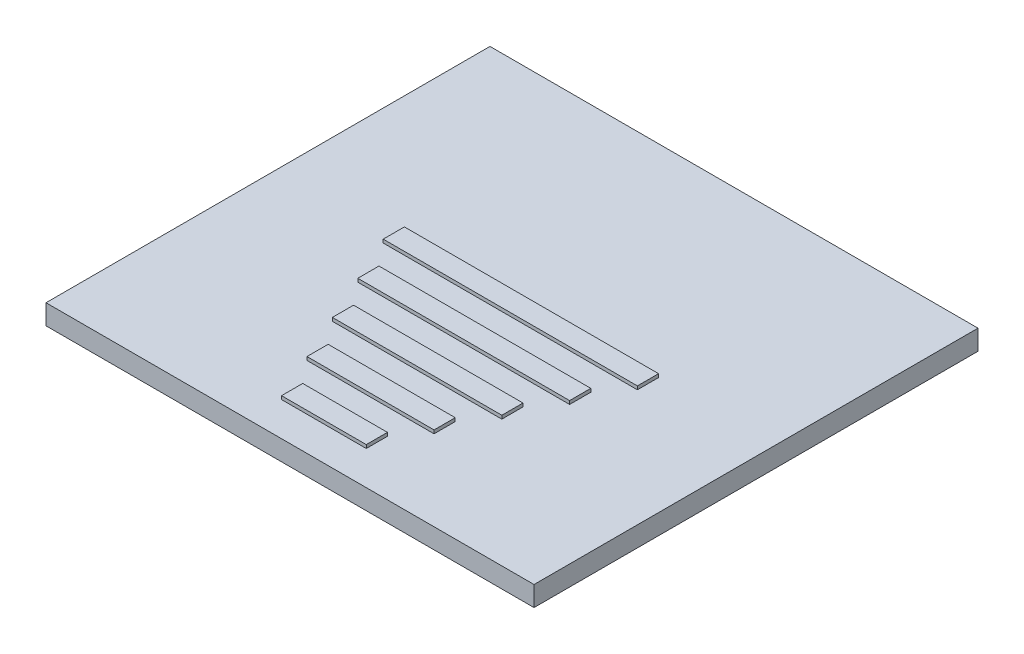
ISO-10303-21;
HEADER;
FILE_DESCRIPTION(('STEP AP214'),'2;1');
FILE_NAME('part.step','',(''),(''),'','','');
FILE_SCHEMA(('AUTOMOTIVE_DESIGN { 1 0 10303 214 1 1 1 1 }'));
ENDSEC;
DATA;
#1=APPLICATION_CONTEXT('core data for automotive mechanical design processes');
#2=APPLICATION_PROTOCOL_DEFINITION('international standard','automotive_design',2000,#1);
#3=PRODUCT_CONTEXT('',#1,'mechanical');
#4=PRODUCT('Part','Part','',(#3));
#5=PRODUCT_RELATED_PRODUCT_CATEGORY('part','',(#4));
#6=PRODUCT_DEFINITION_FORMATION('','',#4);
#7=PRODUCT_DEFINITION_CONTEXT('part definition',#1,'design');
#8=PRODUCT_DEFINITION('design','',#6,#7);
#9=PRODUCT_DEFINITION_SHAPE('','',#8);
#10=(LENGTH_UNIT() NAMED_UNIT(*) SI_UNIT(.MILLI.,.METRE.));
#11=(NAMED_UNIT(*) PLANE_ANGLE_UNIT() SI_UNIT($,.RADIAN.));
#12=(NAMED_UNIT(*) SI_UNIT($,.STERADIAN.) SOLID_ANGLE_UNIT());
#13=UNCERTAINTY_MEASURE_WITH_UNIT(LENGTH_MEASURE(1.E-05),#10,'distance_accuracy_value','');
#14=(GEOMETRIC_REPRESENTATION_CONTEXT(3) GLOBAL_UNCERTAINTY_ASSIGNED_CONTEXT((#13)) GLOBAL_UNIT_ASSIGNED_CONTEXT((#10,
#11,#12)) REPRESENTATION_CONTEXT('',''));
#15=CARTESIAN_POINT('',(0.,0.,0.));
#16=DIRECTION('',(0.,0.,1.));
#17=DIRECTION('',(1.,0.,0.));
#18=AXIS2_PLACEMENT_3D('',#15,#16,#17);
#19=CARTESIAN_POINT('',(0.,1.499997,0.));
#20=DIRECTION('',(0.,1.,0.));
#21=DIRECTION('',(0.,0.,1.));
#22=AXIS2_PLACEMENT_3D('',#19,#20,#21);
#23=PLANE('',#22);
#24=DIRECTION('',(0.,0.,1.));
#25=VECTOR('',#24,1.);
#26=CARTESIAN_POINT('',(-18.288,1.499997,16.637));
#27=LINE('',#26,#25);
#28=CARTESIAN_POINT('',(-18.288,1.499997,-16.637));
#29=VERTEX_POINT('',#28);
#30=CARTESIAN_POINT('',(-18.288,1.499997,16.637));
#31=VERTEX_POINT('',#30);
#32=EDGE_CURVE('E398',#29,#31,#27,.T.);
#33=ORIENTED_EDGE('',*,*,#32,.T.);
#34=DIRECTION('',(1.,0.,0.));
#35=VECTOR('',#34,1.);
#36=CARTESIAN_POINT('',(18.288,1.499997,16.637));
#37=LINE('',#36,#35);
#38=CARTESIAN_POINT('',(18.288,1.499997,16.637));
#39=VERTEX_POINT('',#38);
#40=EDGE_CURVE('E402',#31,#39,#37,.T.);
#41=ORIENTED_EDGE('',*,*,#40,.T.);
#42=DIRECTION('',(0.,0.,-1.));
#43=VECTOR('',#42,1.);
#44=CARTESIAN_POINT('',(18.288,1.499997,16.637));
#45=LINE('',#44,#43);
#46=CARTESIAN_POINT('',(18.288,1.499997,-16.637));
#47=VERTEX_POINT('',#46);
#48=EDGE_CURVE('E406',#39,#47,#45,.T.);
#49=ORIENTED_EDGE('',*,*,#48,.T.);
#50=DIRECTION('',(-1.,0.,0.));
#51=VECTOR('',#50,1.);
#52=CARTESIAN_POINT('',(18.288,1.499997,-16.637));
#53=LINE('',#52,#51);
#54=EDGE_CURVE('E409',#47,#29,#53,.T.);
#55=ORIENTED_EDGE('',*,*,#54,.T.);
#56=EDGE_LOOP('',(#33,#41,#49,#55));
#57=FACE_BOUND('',#56,.T.);
#58=DIRECTION('',(1.,0.,0.));
#59=VECTOR('',#58,1.);
#60=CARTESIAN_POINT('',(-9.525,1.499997,0.126999999999997));
#61=LINE('',#60,#59);
#62=CARTESIAN_POINT('',(-9.525,1.499997,0.126999999999997));
#63=VERTEX_POINT('',#62);
#64=CARTESIAN_POINT('',(9.525,1.499997,0.126999999999997));
#65=VERTEX_POINT('',#64);
#66=EDGE_CURVE('E375',#63,#65,#61,.T.);
#67=ORIENTED_EDGE('',*,*,#66,.F.);
#68=DIRECTION('',(0.,0.,1.));
#69=VECTOR('',#68,1.);
#70=CARTESIAN_POINT('',(-9.525,1.499997,-1.4605));
#71=LINE('',#70,#69);
#72=CARTESIAN_POINT('',(-9.525,1.499997,-1.4605));
#73=VERTEX_POINT('',#72);
#74=EDGE_CURVE('E356',#73,#63,#71,.T.);
#75=ORIENTED_EDGE('',*,*,#74,.F.);
#76=DIRECTION('',(-1.,0.,0.));
#77=VECTOR('',#76,1.);
#78=CARTESIAN_POINT('',(-9.525,1.499997,-1.4605));
#79=LINE('',#78,#77);
#80=CARTESIAN_POINT('',(9.525,1.499997,-1.4605));
#81=VERTEX_POINT('',#80);
#82=EDGE_CURVE('E362',#81,#73,#79,.T.);
#83=ORIENTED_EDGE('',*,*,#82,.F.);
#84=DIRECTION('',(0.,0.,-1.));
#85=VECTOR('',#84,1.);
#86=CARTESIAN_POINT('',(9.525,1.499997,-1.4605));
#87=LINE('',#86,#85);
#88=EDGE_CURVE('E378',#65,#81,#87,.T.);
#89=ORIENTED_EDGE('',*,*,#88,.F.);
#90=EDGE_LOOP('',(#67,#75,#83,#89));
#91=FACE_BOUND('',#90,.T.);
#92=DIRECTION('',(1.,0.,0.));
#93=VECTOR('',#92,1.);
#94=CARTESIAN_POINT('',(-6.35,1.499997,7.112));
#95=LINE('',#94,#93);
#96=CARTESIAN_POINT('',(-6.35,1.499997,7.112));
#97=VERTEX_POINT('',#96);
#98=CARTESIAN_POINT('',(6.35,1.499997,7.11199999999999));
#99=VERTEX_POINT('',#98);
#100=EDGE_CURVE('E334',#97,#99,#95,.T.);
#101=ORIENTED_EDGE('',*,*,#100,.F.);
#102=DIRECTION('',(0.,0.,1.));
#103=VECTOR('',#102,1.);
#104=CARTESIAN_POINT('',(-6.35,1.499997,5.5245));
#105=LINE('',#104,#103);
#106=CARTESIAN_POINT('',(-6.35,1.499997,5.5245));
#107=VERTEX_POINT('',#106);
#108=EDGE_CURVE('E315',#107,#97,#105,.T.);
#109=ORIENTED_EDGE('',*,*,#108,.F.);
#110=DIRECTION('',(-1.,0.,0.));
#111=VECTOR('',#110,1.);
#112=CARTESIAN_POINT('',(-6.35,1.499997,5.5245));
#113=LINE('',#112,#111);
#114=CARTESIAN_POINT('',(6.35,1.499997,5.52449999999999));
#115=VERTEX_POINT('',#114);
#116=EDGE_CURVE('E321',#115,#107,#113,.T.);
#117=ORIENTED_EDGE('',*,*,#116,.F.);
#118=DIRECTION('',(0.,0.,-1.));
#119=VECTOR('',#118,1.);
#120=CARTESIAN_POINT('',(6.35,1.499997,5.52449999999999));
#121=LINE('',#120,#119);
#122=EDGE_CURVE('E337',#99,#115,#121,.T.);
#123=ORIENTED_EDGE('',*,*,#122,.F.);
#124=EDGE_LOOP('',(#101,#109,#117,#123));
#125=FACE_BOUND('',#124,.T.);
#126=DIRECTION('',(1.,0.,0.));
#127=VECTOR('',#126,1.);
#128=CARTESIAN_POINT('',(-4.7625,1.499997,10.6045));
#129=LINE('',#128,#127);
#130=CARTESIAN_POINT('',(-4.7625,1.499997,10.6045));
#131=VERTEX_POINT('',#130);
#132=CARTESIAN_POINT('',(4.7625,1.499997,10.6045));
#133=VERTEX_POINT('',#132);
#134=EDGE_CURVE('E293',#131,#133,#129,.T.);
#135=ORIENTED_EDGE('',*,*,#134,.F.);
#136=DIRECTION('',(0.,0.,1.));
#137=VECTOR('',#136,1.);
#138=CARTESIAN_POINT('',(-4.7625,1.499997,9.017));
#139=LINE('',#138,#137);
#140=CARTESIAN_POINT('',(-4.7625,1.499997,9.017));
#141=VERTEX_POINT('',#140);
#142=EDGE_CURVE('E274',#141,#131,#139,.T.);
#143=ORIENTED_EDGE('',*,*,#142,.F.);
#144=DIRECTION('',(-1.,0.,0.));
#145=VECTOR('',#144,1.);
#146=CARTESIAN_POINT('',(-4.7625,1.499997,9.017));
#147=LINE('',#146,#145);
#148=CARTESIAN_POINT('',(4.7625,1.499997,9.017));
#149=VERTEX_POINT('',#148);
#150=EDGE_CURVE('E280',#149,#141,#147,.T.);
#151=ORIENTED_EDGE('',*,*,#150,.F.);
#152=DIRECTION('',(0.,0.,-1.));
#153=VECTOR('',#152,1.);
#154=CARTESIAN_POINT('',(4.7625,1.499997,9.017));
#155=LINE('',#154,#153);
#156=EDGE_CURVE('E296',#133,#149,#155,.T.);
#157=ORIENTED_EDGE('',*,*,#156,.F.);
#158=EDGE_LOOP('',(#135,#143,#151,#157));
#159=FACE_BOUND('',#158,.T.);
#160=DIRECTION('',(1.,0.,0.));
#161=VECTOR('',#160,1.);
#162=CARTESIAN_POINT('',(-3.175,1.499997,14.097));
#163=LINE('',#162,#161);
#164=CARTESIAN_POINT('',(-3.175,1.499997,14.097));
#165=VERTEX_POINT('',#164);
#166=CARTESIAN_POINT('',(3.175,1.499997,14.097));
#167=VERTEX_POINT('',#166);
#168=EDGE_CURVE('E235',#165,#167,#163,.T.);
#169=ORIENTED_EDGE('',*,*,#168,.F.);
#170=DIRECTION('',(0.,0.,1.));
#171=VECTOR('',#170,1.);
#172=CARTESIAN_POINT('',(-3.175,1.499997,12.5095));
#173=LINE('',#172,#171);
#174=CARTESIAN_POINT('',(-3.175,1.499997,12.5095));
#175=VERTEX_POINT('',#174);
#176=EDGE_CURVE('E230',#175,#165,#173,.T.);
#177=ORIENTED_EDGE('',*,*,#176,.F.);
#178=DIRECTION('',(-1.,0.,0.));
#179=VECTOR('',#178,1.);
#180=CARTESIAN_POINT('',(-3.175,1.499997,12.5095));
#181=LINE('',#180,#179);
#182=CARTESIAN_POINT('',(3.175,1.499997,12.5095));
#183=VERTEX_POINT('',#182);
#184=EDGE_CURVE('E245',#183,#175,#181,.T.);
#185=ORIENTED_EDGE('',*,*,#184,.F.);
#186=DIRECTION('',(0.,0.,-1.));
#187=VECTOR('',#186,1.);
#188=CARTESIAN_POINT('',(3.175,1.499997,12.5095));
#189=LINE('',#188,#187);
#190=EDGE_CURVE('E257',#167,#183,#189,.T.);
#191=ORIENTED_EDGE('',*,*,#190,.F.);
#192=EDGE_LOOP('',(#169,#177,#185,#191));
#193=FACE_BOUND('',#192,.T.);
#194=DIRECTION('',(1.,0.,0.));
#195=VECTOR('',#194,1.);
#196=CARTESIAN_POINT('',(-7.9375,1.499997,3.6195));
#197=LINE('',#196,#195);
#198=CARTESIAN_POINT('',(-7.9375,1.499997,3.6195));
#199=VERTEX_POINT('',#198);
#200=CARTESIAN_POINT('',(7.9375,1.499997,3.6195));
#201=VERTEX_POINT('',#200);
#202=EDGE_CURVE('E750',#199,#201,#197,.T.);
#203=ORIENTED_EDGE('',*,*,#202,.F.);
#204=DIRECTION('',(0.,0.,1.));
#205=VECTOR('',#204,1.);
#206=CARTESIAN_POINT('',(-7.9375,1.499997,2.032));
#207=LINE('',#206,#205);
#208=CARTESIAN_POINT('',(-7.9375,1.499997,2.032));
#209=VERTEX_POINT('',#208);
#210=EDGE_CURVE('E227',#209,#199,#207,.T.);
#211=ORIENTED_EDGE('',*,*,#210,.F.);
#212=DIRECTION('',(-1.,0.,0.));
#213=VECTOR('',#212,1.);
#214=CARTESIAN_POINT('',(-7.9375,1.499997,2.032));
#215=LINE('',#214,#213);
#216=CARTESIAN_POINT('',(7.9375,1.499997,2.032));
#217=VERTEX_POINT('',#216);
#218=EDGE_CURVE('E223',#217,#209,#215,.T.);
#219=ORIENTED_EDGE('',*,*,#218,.F.);
#220=DIRECTION('',(0.,0.,-1.));
#221=VECTOR('',#220,1.);
#222=CARTESIAN_POINT('',(7.9375,1.499997,2.032));
#223=LINE('',#222,#221);
#224=EDGE_CURVE('E746',#201,#217,#223,.T.);
#225=ORIENTED_EDGE('',*,*,#224,.F.);
#226=EDGE_LOOP('',(#203,#211,#219,#225));
#227=FACE_BOUND('',#226,.T.);
#228=ADVANCED_FACE('F39',(#57,#91,#125,#159,#193,#227),#23,.T.);
#229=CARTESIAN_POINT('',(-18.288,1.499997,16.637));
#230=DIRECTION('',(1.,0.,0.));
#231=DIRECTION('',(0.,0.,-1.));
#232=AXIS2_PLACEMENT_3D('',#229,#230,#231);
#233=PLANE('',#232);
#234=DIRECTION('',(0.,0.,1.));
#235=VECTOR('',#234,1.);
#236=CARTESIAN_POINT('',(-18.288,0.,16.637));
#237=LINE('',#236,#235);
#238=CARTESIAN_POINT('',(-18.288,0.,-16.637));
#239=VERTEX_POINT('',#238);
#240=CARTESIAN_POINT('',(-18.288,0.,16.637));
#241=VERTEX_POINT('',#240);
#242=EDGE_CURVE('E397',#239,#241,#237,.T.);
#243=ORIENTED_EDGE('',*,*,#242,.T.);
#244=DIRECTION('',(0.,-1.,0.));
#245=VECTOR('',#244,1.);
#246=CARTESIAN_POINT('',(-18.288,1.499997,16.637));
#247=LINE('',#246,#245);
#248=EDGE_CURVE('E11',#31,#241,#247,.T.);
#249=ORIENTED_EDGE('',*,*,#248,.F.);
#250=ORIENTED_EDGE('',*,*,#32,.F.);
#251=DIRECTION('',(0.,-1.,0.));
#252=VECTOR('',#251,1.);
#253=CARTESIAN_POINT('',(-18.288,1.499997,-16.637));
#254=LINE('',#253,#252);
#255=EDGE_CURVE('E412',#29,#239,#254,.T.);
#256=ORIENTED_EDGE('',*,*,#255,.T.);
#257=EDGE_LOOP('',(#243,#249,#250,#256));
#258=FACE_BOUND('',#257,.T.);
#259=ADVANCED_FACE('F41',(#258),#233,.F.);
#260=CARTESIAN_POINT('',(18.288,1.499997,16.637));
#261=DIRECTION('',(0.,0.,-1.));
#262=DIRECTION('',(-1.,0.,0.));
#263=AXIS2_PLACEMENT_3D('',#260,#261,#262);
#264=PLANE('',#263);
#265=DIRECTION('',(1.,0.,0.));
#266=VECTOR('',#265,1.);
#267=CARTESIAN_POINT('',(18.288,0.,16.637));
#268=LINE('',#267,#266);
#269=CARTESIAN_POINT('',(18.288,0.,16.637));
#270=VERTEX_POINT('',#269);
#271=EDGE_CURVE('E416',#241,#270,#268,.T.);
#272=ORIENTED_EDGE('',*,*,#271,.T.);
#273=DIRECTION('',(0.,-1.,0.));
#274=VECTOR('',#273,1.);
#275=CARTESIAN_POINT('',(18.288,1.499997,16.637));
#276=LINE('',#275,#274);
#277=EDGE_CURVE('E48',#39,#270,#276,.T.);
#278=ORIENTED_EDGE('',*,*,#277,.F.);
#279=ORIENTED_EDGE('',*,*,#40,.F.);
#280=ORIENTED_EDGE('',*,*,#248,.T.);
#281=EDGE_LOOP('',(#272,#278,#279,#280));
#282=FACE_BOUND('',#281,.T.);
#283=ADVANCED_FACE('F452',(#282),#264,.F.);
#284=CARTESIAN_POINT('',(18.288,1.499997,16.637));
#285=DIRECTION('',(-1.,0.,0.));
#286=DIRECTION('',(0.,0.,1.));
#287=AXIS2_PLACEMENT_3D('',#284,#285,#286);
#288=PLANE('',#287);
#289=DIRECTION('',(0.,0.,-1.));
#290=VECTOR('',#289,1.);
#291=CARTESIAN_POINT('',(18.288,0.,16.637));
#292=LINE('',#291,#290);
#293=CARTESIAN_POINT('',(18.288,0.,-16.637));
#294=VERTEX_POINT('',#293);
#295=EDGE_CURVE('E419',#270,#294,#292,.T.);
#296=ORIENTED_EDGE('',*,*,#295,.T.);
#297=DIRECTION('',(0.,-1.,0.));
#298=VECTOR('',#297,1.);
#299=CARTESIAN_POINT('',(18.288,1.499997,-16.637));
#300=LINE('',#299,#298);
#301=EDGE_CURVE('E427',#47,#294,#300,.T.);
#302=ORIENTED_EDGE('',*,*,#301,.F.);
#303=ORIENTED_EDGE('',*,*,#48,.F.);
#304=ORIENTED_EDGE('',*,*,#277,.T.);
#305=EDGE_LOOP('',(#296,#302,#303,#304));
#306=FACE_BOUND('',#305,.T.);
#307=ADVANCED_FACE('F436',(#306),#288,.F.);
#308=CARTESIAN_POINT('',(18.288,1.499997,-16.637));
#309=DIRECTION('',(0.,0.,1.));
#310=DIRECTION('',(1.,0.,0.));
#311=AXIS2_PLACEMENT_3D('',#308,#309,#310);
#312=PLANE('',#311);
#313=DIRECTION('',(-1.,0.,0.));
#314=VECTOR('',#313,1.);
#315=CARTESIAN_POINT('',(18.288,0.,-16.637));
#316=LINE('',#315,#314);
#317=EDGE_CURVE('E403',#294,#239,#316,.T.);
#318=ORIENTED_EDGE('',*,*,#317,.T.);
#319=ORIENTED_EDGE('',*,*,#255,.F.);
#320=ORIENTED_EDGE('',*,*,#54,.F.);
#321=ORIENTED_EDGE('',*,*,#301,.T.);
#322=EDGE_LOOP('',(#318,#319,#320,#321));
#323=FACE_BOUND('',#322,.T.);
#324=ADVANCED_FACE('F445',(#323),#312,.F.);
#325=CARTESIAN_POINT('',(0.,0.,0.));
#326=DIRECTION('',(0.,1.,0.));
#327=DIRECTION('',(0.,0.,1.));
#328=AXIS2_PLACEMENT_3D('',#325,#326,#327);
#329=PLANE('',#328);
#330=ORIENTED_EDGE('',*,*,#242,.F.);
#331=ORIENTED_EDGE('',*,*,#317,.F.);
#332=ORIENTED_EDGE('',*,*,#295,.F.);
#333=ORIENTED_EDGE('',*,*,#271,.F.);
#334=EDGE_LOOP('',(#330,#331,#332,#333));
#335=FACE_BOUND('',#334,.T.);
#336=ADVANCED_FACE('F442',(#335),#329,.F.);
#337=CARTESIAN_POINT('',(-9.525,1.753997,-1.4605));
#338=DIRECTION('',(1.,0.,0.));
#339=DIRECTION('',(0.,0.,-1.));
#340=AXIS2_PLACEMENT_3D('',#337,#338,#339);
#341=PLANE('',#340);
#342=ORIENTED_EDGE('',*,*,#74,.T.);
#343=DIRECTION('',(0.,-1.,0.));
#344=VECTOR('',#343,1.);
#345=CARTESIAN_POINT('',(-9.525,1.753997,0.126999999999997));
#346=LINE('',#345,#344);
#347=CARTESIAN_POINT('',(-9.525,1.753997,0.126999999999997));
#348=VERTEX_POINT('',#347);
#349=EDGE_CURVE('E394',#348,#63,#346,.T.);
#350=ORIENTED_EDGE('',*,*,#349,.F.);
#351=DIRECTION('',(0.,0.,1.));
#352=VECTOR('',#351,1.);
#353=CARTESIAN_POINT('',(-9.525,1.753997,-1.4605));
#354=LINE('',#353,#352);
#355=CARTESIAN_POINT('',(-9.525,1.753997,-1.4605));
#356=VERTEX_POINT('',#355);
#357=EDGE_CURVE('E357',#356,#348,#354,.T.);
#358=ORIENTED_EDGE('',*,*,#357,.F.);
#359=DIRECTION('',(0.,-1.,0.));
#360=VECTOR('',#359,1.);
#361=CARTESIAN_POINT('',(-9.525,1.753997,-1.4605));
#362=LINE('',#361,#360);
#363=EDGE_CURVE('E371',#356,#73,#362,.T.);
#364=ORIENTED_EDGE('',*,*,#363,.T.);
#365=EDGE_LOOP('',(#342,#350,#358,#364));
#366=FACE_BOUND('',#365,.T.);
#367=ADVANCED_FACE('F465',(#366),#341,.F.);
#368=CARTESIAN_POINT('',(-9.525,1.753997,0.126999999999997));
#369=DIRECTION('',(0.,0.,-1.));
#370=DIRECTION('',(-1.,0.,0.));
#371=AXIS2_PLACEMENT_3D('',#368,#369,#370);
#372=PLANE('',#371);
#373=ORIENTED_EDGE('',*,*,#66,.T.);
#374=DIRECTION('',(0.,-1.,0.));
#375=VECTOR('',#374,1.);
#376=CARTESIAN_POINT('',(9.525,1.753997,0.126999999999997));
#377=LINE('',#376,#375);
#378=CARTESIAN_POINT('',(9.525,1.753997,0.126999999999997));
#379=VERTEX_POINT('',#378);
#380=EDGE_CURVE('E390',#379,#65,#377,.T.);
#381=ORIENTED_EDGE('',*,*,#380,.F.);
#382=DIRECTION('',(1.,0.,0.));
#383=VECTOR('',#382,1.);
#384=CARTESIAN_POINT('',(-9.525,1.753997,0.126999999999997));
#385=LINE('',#384,#383);
#386=EDGE_CURVE('E361',#348,#379,#385,.T.);
#387=ORIENTED_EDGE('',*,*,#386,.F.);
#388=ORIENTED_EDGE('',*,*,#349,.T.);
#389=EDGE_LOOP('',(#373,#381,#387,#388));
#390=FACE_BOUND('',#389,.T.);
#391=ADVANCED_FACE('F484',(#390),#372,.F.);
#392=CARTESIAN_POINT('',(9.525,1.753997,-1.4605));
#393=DIRECTION('',(-1.,0.,0.));
#394=DIRECTION('',(0.,0.,1.));
#395=AXIS2_PLACEMENT_3D('',#392,#393,#394);
#396=PLANE('',#395);
#397=ORIENTED_EDGE('',*,*,#88,.T.);
#398=DIRECTION('',(0.,-1.,0.));
#399=VECTOR('',#398,1.);
#400=CARTESIAN_POINT('',(9.525,1.753997,-1.4605));
#401=LINE('',#400,#399);
#402=CARTESIAN_POINT('',(9.525,1.753997,-1.4605));
#403=VERTEX_POINT('',#402);
#404=EDGE_CURVE('E387',#403,#81,#401,.T.);
#405=ORIENTED_EDGE('',*,*,#404,.F.);
#406=DIRECTION('',(0.,0.,-1.));
#407=VECTOR('',#406,1.);
#408=CARTESIAN_POINT('',(9.525,1.753997,-1.4605));
#409=LINE('',#408,#407);
#410=EDGE_CURVE('E365',#379,#403,#409,.T.);
#411=ORIENTED_EDGE('',*,*,#410,.F.);
#412=ORIENTED_EDGE('',*,*,#380,.T.);
#413=EDGE_LOOP('',(#397,#405,#411,#412));
#414=FACE_BOUND('',#413,.T.);
#415=ADVANCED_FACE('F491',(#414),#396,.F.);
#416=CARTESIAN_POINT('',(-9.525,1.753997,-1.4605));
#417=DIRECTION('',(0.,0.,1.));
#418=DIRECTION('',(1.,0.,0.));
#419=AXIS2_PLACEMENT_3D('',#416,#417,#418);
#420=PLANE('',#419);
#421=ORIENTED_EDGE('',*,*,#82,.T.);
#422=ORIENTED_EDGE('',*,*,#363,.F.);
#423=DIRECTION('',(-1.,0.,0.));
#424=VECTOR('',#423,1.);
#425=CARTESIAN_POINT('',(-9.525,1.753997,-1.4605));
#426=LINE('',#425,#424);
#427=EDGE_CURVE('E368',#403,#356,#426,.T.);
#428=ORIENTED_EDGE('',*,*,#427,.F.);
#429=ORIENTED_EDGE('',*,*,#404,.T.);
#430=EDGE_LOOP('',(#421,#422,#428,#429));
#431=FACE_BOUND('',#430,.T.);
#432=ADVANCED_FACE('F498',(#431),#420,.F.);
#433=CARTESIAN_POINT('',(0.,1.753997,0.));
#434=DIRECTION('',(0.,1.,0.));
#435=DIRECTION('',(0.,0.,1.));
#436=AXIS2_PLACEMENT_3D('',#433,#434,#435);
#437=PLANE('',#436);
#438=ORIENTED_EDGE('',*,*,#357,.T.);
#439=ORIENTED_EDGE('',*,*,#386,.T.);
#440=ORIENTED_EDGE('',*,*,#410,.T.);
#441=ORIENTED_EDGE('',*,*,#427,.T.);
#442=EDGE_LOOP('',(#438,#439,#440,#441));
#443=FACE_BOUND('',#442,.T.);
#444=ADVANCED_FACE('F506',(#443),#437,.T.);
#445=CARTESIAN_POINT('',(-6.35,1.753997,5.5245));
#446=DIRECTION('',(1.,0.,0.));
#447=DIRECTION('',(0.,0.,-1.));
#448=AXIS2_PLACEMENT_3D('',#445,#446,#447);
#449=PLANE('',#448);
#450=ORIENTED_EDGE('',*,*,#108,.T.);
#451=DIRECTION('',(0.,-1.,0.));
#452=VECTOR('',#451,1.);
#453=CARTESIAN_POINT('',(-6.35,1.753997,7.112));
#454=LINE('',#453,#452);
#455=CARTESIAN_POINT('',(-6.35,1.753997,7.112));
#456=VERTEX_POINT('',#455);
#457=EDGE_CURVE('E353',#456,#97,#454,.T.);
#458=ORIENTED_EDGE('',*,*,#457,.F.);
#459=DIRECTION('',(0.,0.,1.));
#460=VECTOR('',#459,1.);
#461=CARTESIAN_POINT('',(-6.35,1.753997,5.5245));
#462=LINE('',#461,#460);
#463=CARTESIAN_POINT('',(-6.35,1.753997,5.5245));
#464=VERTEX_POINT('',#463);
#465=EDGE_CURVE('E316',#464,#456,#462,.T.);
#466=ORIENTED_EDGE('',*,*,#465,.F.);
#467=DIRECTION('',(0.,-1.,0.));
#468=VECTOR('',#467,1.);
#469=CARTESIAN_POINT('',(-6.35,1.753997,5.5245));
#470=LINE('',#469,#468);
#471=EDGE_CURVE('E330',#464,#107,#470,.T.);
#472=ORIENTED_EDGE('',*,*,#471,.T.);
#473=EDGE_LOOP('',(#450,#458,#466,#472));
#474=FACE_BOUND('',#473,.T.);
#475=ADVANCED_FACE('F514',(#474),#449,.F.);
#476=CARTESIAN_POINT('',(-6.35,1.753997,7.112));
#477=DIRECTION('',(0.,0.,-1.));
#478=DIRECTION('',(-1.,0.,0.));
#479=AXIS2_PLACEMENT_3D('',#476,#477,#478);
#480=PLANE('',#479);
#481=ORIENTED_EDGE('',*,*,#100,.T.);
#482=DIRECTION('',(0.,-1.,0.));
#483=VECTOR('',#482,1.);
#484=CARTESIAN_POINT('',(6.35,1.753997,7.11199999999999));
#485=LINE('',#484,#483);
#486=CARTESIAN_POINT('',(6.35,1.753997,7.11199999999999));
#487=VERTEX_POINT('',#486);
#488=EDGE_CURVE('E349',#487,#99,#485,.T.);
#489=ORIENTED_EDGE('',*,*,#488,.F.);
#490=DIRECTION('',(1.,0.,0.));
#491=VECTOR('',#490,1.);
#492=CARTESIAN_POINT('',(-6.35,1.753997,7.112));
#493=LINE('',#492,#491);
#494=EDGE_CURVE('E320',#456,#487,#493,.T.);
#495=ORIENTED_EDGE('',*,*,#494,.F.);
#496=ORIENTED_EDGE('',*,*,#457,.T.);
#497=EDGE_LOOP('',(#481,#489,#495,#496));
#498=FACE_BOUND('',#497,.T.);
#499=ADVANCED_FACE('F522',(#498),#480,.F.);
#500=CARTESIAN_POINT('',(6.35,1.753997,5.52449999999999));
#501=DIRECTION('',(-1.,0.,0.));
#502=DIRECTION('',(0.,0.,1.));
#503=AXIS2_PLACEMENT_3D('',#500,#501,#502);
#504=PLANE('',#503);
#505=ORIENTED_EDGE('',*,*,#122,.T.);
#506=DIRECTION('',(0.,-1.,0.));
#507=VECTOR('',#506,1.);
#508=CARTESIAN_POINT('',(6.35,1.753997,5.52449999999999));
#509=LINE('',#508,#507);
#510=CARTESIAN_POINT('',(6.35,1.753997,5.52449999999999));
#511=VERTEX_POINT('',#510);
#512=EDGE_CURVE('E346',#511,#115,#509,.T.);
#513=ORIENTED_EDGE('',*,*,#512,.F.);
#514=DIRECTION('',(0.,0.,-1.));
#515=VECTOR('',#514,1.);
#516=CARTESIAN_POINT('',(6.35,1.753997,5.52449999999999));
#517=LINE('',#516,#515);
#518=EDGE_CURVE('E324',#487,#511,#517,.T.);
#519=ORIENTED_EDGE('',*,*,#518,.F.);
#520=ORIENTED_EDGE('',*,*,#488,.T.);
#521=EDGE_LOOP('',(#505,#513,#519,#520));
#522=FACE_BOUND('',#521,.T.);
#523=ADVANCED_FACE('F530',(#522),#504,.F.);
#524=CARTESIAN_POINT('',(-6.35,1.753997,5.5245));
#525=DIRECTION('',(0.,0.,1.));
#526=DIRECTION('',(1.,0.,0.));
#527=AXIS2_PLACEMENT_3D('',#524,#525,#526);
#528=PLANE('',#527);
#529=ORIENTED_EDGE('',*,*,#116,.T.);
#530=ORIENTED_EDGE('',*,*,#471,.F.);
#531=DIRECTION('',(-1.,0.,0.));
#532=VECTOR('',#531,1.);
#533=CARTESIAN_POINT('',(-6.35,1.753997,5.5245));
#534=LINE('',#533,#532);
#535=EDGE_CURVE('E327',#511,#464,#534,.T.);
#536=ORIENTED_EDGE('',*,*,#535,.F.);
#537=ORIENTED_EDGE('',*,*,#512,.T.);
#538=EDGE_LOOP('',(#529,#530,#536,#537));
#539=FACE_BOUND('',#538,.T.);
#540=ADVANCED_FACE('F538',(#539),#528,.F.);
#541=CARTESIAN_POINT('',(0.,1.753997,0.));
#542=DIRECTION('',(0.,1.,0.));
#543=DIRECTION('',(0.,0.,1.));
#544=AXIS2_PLACEMENT_3D('',#541,#542,#543);
#545=PLANE('',#544);
#546=ORIENTED_EDGE('',*,*,#465,.T.);
#547=ORIENTED_EDGE('',*,*,#494,.T.);
#548=ORIENTED_EDGE('',*,*,#518,.T.);
#549=ORIENTED_EDGE('',*,*,#535,.T.);
#550=EDGE_LOOP('',(#546,#547,#548,#549));
#551=FACE_BOUND('',#550,.T.);
#552=ADVANCED_FACE('F546',(#551),#545,.T.);
#553=CARTESIAN_POINT('',(-4.7625,1.753997,9.017));
#554=DIRECTION('',(1.,0.,0.));
#555=DIRECTION('',(0.,0.,-1.));
#556=AXIS2_PLACEMENT_3D('',#553,#554,#555);
#557=PLANE('',#556);
#558=ORIENTED_EDGE('',*,*,#142,.T.);
#559=DIRECTION('',(0.,-1.,0.));
#560=VECTOR('',#559,1.);
#561=CARTESIAN_POINT('',(-4.7625,1.753997,10.6045));
#562=LINE('',#561,#560);
#563=CARTESIAN_POINT('',(-4.7625,1.753997,10.6045));
#564=VERTEX_POINT('',#563);
#565=EDGE_CURVE('E312',#564,#131,#562,.T.);
#566=ORIENTED_EDGE('',*,*,#565,.F.);
#567=DIRECTION('',(0.,0.,1.));
#568=VECTOR('',#567,1.);
#569=CARTESIAN_POINT('',(-4.7625,1.753997,9.017));
#570=LINE('',#569,#568);
#571=CARTESIAN_POINT('',(-4.7625,1.753997,9.017));
#572=VERTEX_POINT('',#571);
#573=EDGE_CURVE('E275',#572,#564,#570,.T.);
#574=ORIENTED_EDGE('',*,*,#573,.F.);
#575=DIRECTION('',(0.,-1.,0.));
#576=VECTOR('',#575,1.);
#577=CARTESIAN_POINT('',(-4.7625,1.753997,9.017));
#578=LINE('',#577,#576);
#579=EDGE_CURVE('E289',#572,#141,#578,.T.);
#580=ORIENTED_EDGE('',*,*,#579,.T.);
#581=EDGE_LOOP('',(#558,#566,#574,#580));
#582=FACE_BOUND('',#581,.T.);
#583=ADVANCED_FACE('F554',(#582),#557,.F.);
#584=CARTESIAN_POINT('',(-4.7625,1.753997,10.6045));
#585=DIRECTION('',(0.,0.,-1.));
#586=DIRECTION('',(-1.,0.,0.));
#587=AXIS2_PLACEMENT_3D('',#584,#585,#586);
#588=PLANE('',#587);
#589=ORIENTED_EDGE('',*,*,#134,.T.);
#590=DIRECTION('',(0.,-1.,0.));
#591=VECTOR('',#590,1.);
#592=CARTESIAN_POINT('',(4.7625,1.753997,10.6045));
#593=LINE('',#592,#591);
#594=CARTESIAN_POINT('',(4.7625,1.753997,10.6045));
#595=VERTEX_POINT('',#594);
#596=EDGE_CURVE('E308',#595,#133,#593,.T.);
#597=ORIENTED_EDGE('',*,*,#596,.F.);
#598=DIRECTION('',(1.,0.,0.));
#599=VECTOR('',#598,1.);
#600=CARTESIAN_POINT('',(-4.7625,1.753997,10.6045));
#601=LINE('',#600,#599);
#602=EDGE_CURVE('E279',#564,#595,#601,.T.);
#603=ORIENTED_EDGE('',*,*,#602,.F.);
#604=ORIENTED_EDGE('',*,*,#565,.T.);
#605=EDGE_LOOP('',(#589,#597,#603,#604));
#606=FACE_BOUND('',#605,.T.);
#607=ADVANCED_FACE('F562',(#606),#588,.F.);
#608=CARTESIAN_POINT('',(4.7625,1.753997,9.017));
#609=DIRECTION('',(-1.,0.,0.));
#610=DIRECTION('',(0.,0.,1.));
#611=AXIS2_PLACEMENT_3D('',#608,#609,#610);
#612=PLANE('',#611);
#613=ORIENTED_EDGE('',*,*,#156,.T.);
#614=DIRECTION('',(0.,-1.,0.));
#615=VECTOR('',#614,1.);
#616=CARTESIAN_POINT('',(4.7625,1.753997,9.017));
#617=LINE('',#616,#615);
#618=CARTESIAN_POINT('',(4.7625,1.753997,9.017));
#619=VERTEX_POINT('',#618);
#620=EDGE_CURVE('E305',#619,#149,#617,.T.);
#621=ORIENTED_EDGE('',*,*,#620,.F.);
#622=DIRECTION('',(0.,0.,-1.));
#623=VECTOR('',#622,1.);
#624=CARTESIAN_POINT('',(4.7625,1.753997,9.017));
#625=LINE('',#624,#623);
#626=EDGE_CURVE('E283',#595,#619,#625,.T.);
#627=ORIENTED_EDGE('',*,*,#626,.F.);
#628=ORIENTED_EDGE('',*,*,#596,.T.);
#629=EDGE_LOOP('',(#613,#621,#627,#628));
#630=FACE_BOUND('',#629,.T.);
#631=ADVANCED_FACE('F570',(#630),#612,.F.);
#632=CARTESIAN_POINT('',(-4.7625,1.753997,9.017));
#633=DIRECTION('',(0.,0.,1.));
#634=DIRECTION('',(1.,0.,0.));
#635=AXIS2_PLACEMENT_3D('',#632,#633,#634);
#636=PLANE('',#635);
#637=ORIENTED_EDGE('',*,*,#150,.T.);
#638=ORIENTED_EDGE('',*,*,#579,.F.);
#639=DIRECTION('',(-1.,0.,0.));
#640=VECTOR('',#639,1.);
#641=CARTESIAN_POINT('',(-4.7625,1.753997,9.017));
#642=LINE('',#641,#640);
#643=EDGE_CURVE('E286',#619,#572,#642,.T.);
#644=ORIENTED_EDGE('',*,*,#643,.F.);
#645=ORIENTED_EDGE('',*,*,#620,.T.);
#646=EDGE_LOOP('',(#637,#638,#644,#645));
#647=FACE_BOUND('',#646,.T.);
#648=ADVANCED_FACE('F578',(#647),#636,.F.);
#649=CARTESIAN_POINT('',(0.,1.753997,0.));
#650=DIRECTION('',(0.,1.,0.));
#651=DIRECTION('',(0.,0.,1.));
#652=AXIS2_PLACEMENT_3D('',#649,#650,#651);
#653=PLANE('',#652);
#654=ORIENTED_EDGE('',*,*,#573,.T.);
#655=ORIENTED_EDGE('',*,*,#602,.T.);
#656=ORIENTED_EDGE('',*,*,#626,.T.);
#657=ORIENTED_EDGE('',*,*,#643,.T.);
#658=EDGE_LOOP('',(#654,#655,#656,#657));
#659=FACE_BOUND('',#658,.T.);
#660=ADVANCED_FACE('F586',(#659),#653,.T.);
#661=CARTESIAN_POINT('',(-3.175,1.753997,12.5095));
#662=DIRECTION('',(1.,0.,0.));
#663=DIRECTION('',(0.,0.,-1.));
#664=AXIS2_PLACEMENT_3D('',#661,#662,#663);
#665=PLANE('',#664);
#666=ORIENTED_EDGE('',*,*,#176,.T.);
#667=DIRECTION('',(0.,-1.,0.));
#668=VECTOR('',#667,1.);
#669=CARTESIAN_POINT('',(-3.175,1.753997,14.097));
#670=LINE('',#669,#668);
#671=CARTESIAN_POINT('',(-3.175,1.753997,14.097));
#672=VERTEX_POINT('',#671);
#673=EDGE_CURVE('E271',#672,#165,#670,.T.);
#674=ORIENTED_EDGE('',*,*,#673,.F.);
#675=DIRECTION('',(0.,0.,1.));
#676=VECTOR('',#675,1.);
#677=CARTESIAN_POINT('',(-3.175,1.753997,12.5095));
#678=LINE('',#677,#676);
#679=CARTESIAN_POINT('',(-3.175,1.753997,12.5095));
#680=VERTEX_POINT('',#679);
#681=EDGE_CURVE('E240',#680,#672,#678,.T.);
#682=ORIENTED_EDGE('',*,*,#681,.F.);
#683=DIRECTION('',(0.,-1.,0.));
#684=VECTOR('',#683,1.);
#685=CARTESIAN_POINT('',(-3.175,1.753997,12.5095));
#686=LINE('',#685,#684);
#687=EDGE_CURVE('E253',#680,#175,#686,.T.);
#688=ORIENTED_EDGE('',*,*,#687,.T.);
#689=EDGE_LOOP('',(#666,#674,#682,#688));
#690=FACE_BOUND('',#689,.T.);
#691=ADVANCED_FACE('F594',(#690),#665,.F.);
#692=CARTESIAN_POINT('',(-3.175,1.753997,14.097));
#693=DIRECTION('',(0.,0.,-1.));
#694=DIRECTION('',(-1.,0.,0.));
#695=AXIS2_PLACEMENT_3D('',#692,#693,#694);
#696=PLANE('',#695);
#697=ORIENTED_EDGE('',*,*,#168,.T.);
#698=DIRECTION('',(0.,-1.,0.));
#699=VECTOR('',#698,1.);
#700=CARTESIAN_POINT('',(3.175,1.753997,14.097));
#701=LINE('',#700,#699);
#702=CARTESIAN_POINT('',(3.175,1.753997,14.097));
#703=VERTEX_POINT('',#702);
#704=EDGE_CURVE('E267',#703,#167,#701,.T.);
#705=ORIENTED_EDGE('',*,*,#704,.F.);
#706=DIRECTION('',(1.,0.,0.));
#707=VECTOR('',#706,1.);
#708=CARTESIAN_POINT('',(-3.175,1.753997,14.097));
#709=LINE('',#708,#707);
#710=EDGE_CURVE('E244',#672,#703,#709,.T.);
#711=ORIENTED_EDGE('',*,*,#710,.F.);
#712=ORIENTED_EDGE('',*,*,#673,.T.);
#713=EDGE_LOOP('',(#697,#705,#711,#712));
#714=FACE_BOUND('',#713,.T.);
#715=ADVANCED_FACE('F602',(#714),#696,.F.);
#716=CARTESIAN_POINT('',(3.175,1.753997,12.5095));
#717=DIRECTION('',(-1.,0.,0.));
#718=DIRECTION('',(0.,0.,1.));
#719=AXIS2_PLACEMENT_3D('',#716,#717,#718);
#720=PLANE('',#719);
#721=ORIENTED_EDGE('',*,*,#190,.T.);
#722=DIRECTION('',(0.,-1.,0.));
#723=VECTOR('',#722,1.);
#724=CARTESIAN_POINT('',(3.175,1.753997,12.5095));
#725=LINE('',#724,#723);
#726=CARTESIAN_POINT('',(3.175,1.753997,12.5095));
#727=VERTEX_POINT('',#726);
#728=EDGE_CURVE('E63',#727,#183,#725,.T.);
#729=ORIENTED_EDGE('',*,*,#728,.F.);
#730=DIRECTION('',(0.,0.,-1.));
#731=VECTOR('',#730,1.);
#732=CARTESIAN_POINT('',(3.175,1.753997,12.5095));
#733=LINE('',#732,#731);
#734=EDGE_CURVE('E248',#703,#727,#733,.T.);
#735=ORIENTED_EDGE('',*,*,#734,.F.);
#736=ORIENTED_EDGE('',*,*,#704,.T.);
#737=EDGE_LOOP('',(#721,#729,#735,#736));
#738=FACE_BOUND('',#737,.T.);
#739=ADVANCED_FACE('F610',(#738),#720,.F.);
#740=CARTESIAN_POINT('',(-3.175,1.753997,12.5095));
#741=DIRECTION('',(0.,0.,1.));
#742=DIRECTION('',(1.,0.,0.));
#743=AXIS2_PLACEMENT_3D('',#740,#741,#742);
#744=PLANE('',#743);
#745=ORIENTED_EDGE('',*,*,#184,.T.);
#746=ORIENTED_EDGE('',*,*,#687,.F.);
#747=DIRECTION('',(-1.,0.,0.));
#748=VECTOR('',#747,1.);
#749=CARTESIAN_POINT('',(-3.175,1.753997,12.5095));
#750=LINE('',#749,#748);
#751=EDGE_CURVE('E251',#727,#680,#750,.T.);
#752=ORIENTED_EDGE('',*,*,#751,.F.);
#753=ORIENTED_EDGE('',*,*,#728,.T.);
#754=EDGE_LOOP('',(#745,#746,#752,#753));
#755=FACE_BOUND('',#754,.T.);
#756=ADVANCED_FACE('F618',(#755),#744,.F.);
#757=CARTESIAN_POINT('',(0.,1.753997,0.));
#758=DIRECTION('',(0.,1.,0.));
#759=DIRECTION('',(0.,0.,1.));
#760=AXIS2_PLACEMENT_3D('',#757,#758,#759);
#761=PLANE('',#760);
#762=ORIENTED_EDGE('',*,*,#681,.T.);
#763=ORIENTED_EDGE('',*,*,#710,.T.);
#764=ORIENTED_EDGE('',*,*,#734,.T.);
#765=ORIENTED_EDGE('',*,*,#751,.T.);
#766=EDGE_LOOP('',(#762,#763,#764,#765));
#767=FACE_BOUND('',#766,.T.);
#768=ADVANCED_FACE('F626',(#767),#761,.T.);
#769=CARTESIAN_POINT('',(-7.9375,1.753997,2.032));
#770=DIRECTION('',(1.,0.,0.));
#771=DIRECTION('',(0.,0.,-1.));
#772=AXIS2_PLACEMENT_3D('',#769,#770,#771);
#773=PLANE('',#772);
#774=ORIENTED_EDGE('',*,*,#210,.T.);
#775=DIRECTION('',(0.,-1.,0.));
#776=VECTOR('',#775,1.);
#777=CARTESIAN_POINT('',(-7.9375,1.753997,3.6195));
#778=LINE('',#777,#776);
#779=CARTESIAN_POINT('',(-7.9375,1.753997,3.6195));
#780=VERTEX_POINT('',#779);
#781=EDGE_CURVE('E206',#780,#199,#778,.T.);
#782=ORIENTED_EDGE('',*,*,#781,.F.);
#783=DIRECTION('',(0.,0.,1.));
#784=VECTOR('',#783,1.);
#785=CARTESIAN_POINT('',(-7.9375,1.753997,2.032));
#786=LINE('',#785,#784);
#787=CARTESIAN_POINT('',(-7.9375,1.753997,2.032));
#788=VERTEX_POINT('',#787);
#789=EDGE_CURVE('E214',#788,#780,#786,.T.);
#790=ORIENTED_EDGE('',*,*,#789,.F.);
#791=DIRECTION('',(0.,-1.,0.));
#792=VECTOR('',#791,1.);
#793=CARTESIAN_POINT('',(-7.9375,1.753997,2.032));
#794=LINE('',#793,#792);
#795=EDGE_CURVE('E742',#788,#209,#794,.T.);
#796=ORIENTED_EDGE('',*,*,#795,.T.);
#797=EDGE_LOOP('',(#774,#782,#790,#796));
#798=FACE_BOUND('',#797,.T.);
#799=ADVANCED_FACE('F225',(#798),#773,.F.);
#800=CARTESIAN_POINT('',(-7.9375,1.753997,3.6195));
#801=DIRECTION('',(0.,0.,-1.));
#802=DIRECTION('',(-1.,0.,0.));
#803=AXIS2_PLACEMENT_3D('',#800,#801,#802);
#804=PLANE('',#803);
#805=ORIENTED_EDGE('',*,*,#202,.T.);
#806=DIRECTION('',(0.,-1.,0.));
#807=VECTOR('',#806,1.);
#808=CARTESIAN_POINT('',(7.9375,1.753997,3.6195));
#809=LINE('',#808,#807);
#810=CARTESIAN_POINT('',(7.9375,1.753997,3.6195));
#811=VERTEX_POINT('',#810);
#812=EDGE_CURVE('E209',#811,#201,#809,.T.);
#813=ORIENTED_EDGE('',*,*,#812,.F.);
#814=DIRECTION('',(1.,0.,0.));
#815=VECTOR('',#814,1.);
#816=CARTESIAN_POINT('',(-7.9375,1.753997,3.6195));
#817=LINE('',#816,#815);
#818=EDGE_CURVE('E202',#780,#811,#817,.T.);
#819=ORIENTED_EDGE('',*,*,#818,.F.);
#820=ORIENTED_EDGE('',*,*,#781,.T.);
#821=EDGE_LOOP('',(#805,#813,#819,#820));
#822=FACE_BOUND('',#821,.T.);
#823=ADVANCED_FACE('F204',(#822),#804,.F.);
#824=CARTESIAN_POINT('',(7.9375,1.753997,2.032));
#825=DIRECTION('',(-1.,0.,0.));
#826=DIRECTION('',(0.,0.,1.));
#827=AXIS2_PLACEMENT_3D('',#824,#825,#826);
#828=PLANE('',#827);
#829=ORIENTED_EDGE('',*,*,#224,.T.);
#830=DIRECTION('',(0.,-1.,0.));
#831=VECTOR('',#830,1.);
#832=CARTESIAN_POINT('',(7.9375,1.753997,2.032));
#833=LINE('',#832,#831);
#834=CARTESIAN_POINT('',(7.9375,1.753997,2.032));
#835=VERTEX_POINT('',#834);
#836=EDGE_CURVE('E55',#835,#217,#833,.T.);
#837=ORIENTED_EDGE('',*,*,#836,.F.);
#838=DIRECTION('',(0.,0.,-1.));
#839=VECTOR('',#838,1.);
#840=CARTESIAN_POINT('',(7.9375,1.753997,2.032));
#841=LINE('',#840,#839);
#842=EDGE_CURVE('E213',#811,#835,#841,.T.);
#843=ORIENTED_EDGE('',*,*,#842,.F.);
#844=ORIENTED_EDGE('',*,*,#812,.T.);
#845=EDGE_LOOP('',(#829,#837,#843,#844));
#846=FACE_BOUND('',#845,.T.);
#847=ADVANCED_FACE('F646',(#846),#828,.F.);
#848=CARTESIAN_POINT('',(-7.9375,1.753997,2.032));
#849=DIRECTION('',(0.,0.,1.));
#850=DIRECTION('',(1.,0.,0.));
#851=AXIS2_PLACEMENT_3D('',#848,#849,#850);
#852=PLANE('',#851);
#853=ORIENTED_EDGE('',*,*,#218,.T.);
#854=ORIENTED_EDGE('',*,*,#795,.F.);
#855=DIRECTION('',(-1.,0.,0.));
#856=VECTOR('',#855,1.);
#857=CARTESIAN_POINT('',(-7.9375,1.753997,2.032));
#858=LINE('',#857,#856);
#859=EDGE_CURVE('E218',#835,#788,#858,.T.);
#860=ORIENTED_EDGE('',*,*,#859,.F.);
#861=ORIENTED_EDGE('',*,*,#836,.T.);
#862=EDGE_LOOP('',(#853,#854,#860,#861));
#863=FACE_BOUND('',#862,.T.);
#864=ADVANCED_FACE('F653',(#863),#852,.F.);
#865=CARTESIAN_POINT('',(0.,1.753997,0.));
#866=DIRECTION('',(0.,1.,0.));
#867=DIRECTION('',(0.,0.,1.));
#868=AXIS2_PLACEMENT_3D('',#865,#866,#867);
#869=PLANE('',#868);
#870=ORIENTED_EDGE('',*,*,#789,.T.);
#871=ORIENTED_EDGE('',*,*,#818,.T.);
#872=ORIENTED_EDGE('',*,*,#842,.T.);
#873=ORIENTED_EDGE('',*,*,#859,.T.);
#874=EDGE_LOOP('',(#870,#871,#872,#873));
#875=FACE_BOUND('',#874,.T.);
#876=ADVANCED_FACE('F217',(#875),#869,.T.);
#877=CLOSED_SHELL('',(#228,#259,#283,#307,#324,#336,#367,#391,#415,#432,#444,#475,#499,#523,
#540,#552,#583,#607,#631,#648,#660,#691,#715,#739,#756,#768,#799,#823,#847,#864,#876));
#878=MANIFOLD_SOLID_BREP('B2',#877);
#879=ADVANCED_BREP_SHAPE_REPRESENTATION('',(#18,#878),#14);
#880=SHAPE_DEFINITION_REPRESENTATION(#9,#879);
ENDSEC;
END-ISO-10303-21;
